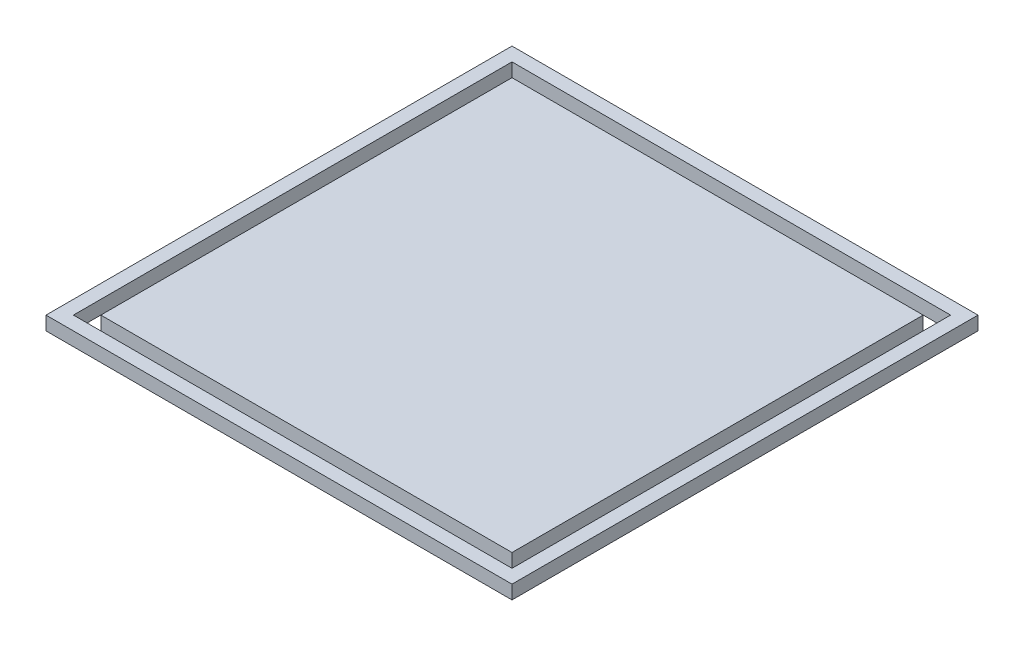
ISO-10303-21;
HEADER;
FILE_DESCRIPTION(('STEP AP214'),'2;1');
FILE_NAME('part.step','',(''),(''),'','','');
FILE_SCHEMA(('AUTOMOTIVE_DESIGN { 1 0 10303 214 1 1 1 1 }'));
ENDSEC;
DATA;
#1=APPLICATION_CONTEXT('core data for automotive mechanical design processes');
#2=APPLICATION_PROTOCOL_DEFINITION('international standard','automotive_design',2000,#1);
#3=PRODUCT_CONTEXT('',#1,'mechanical');
#4=PRODUCT('Part','Part','',(#3));
#5=PRODUCT_RELATED_PRODUCT_CATEGORY('part','',(#4));
#6=PRODUCT_DEFINITION_FORMATION('','',#4);
#7=PRODUCT_DEFINITION_CONTEXT('part definition',#1,'design');
#8=PRODUCT_DEFINITION('design','',#6,#7);
#9=PRODUCT_DEFINITION_SHAPE('','',#8);
#10=(LENGTH_UNIT() NAMED_UNIT(*) SI_UNIT(.MILLI.,.METRE.));
#11=(NAMED_UNIT(*) PLANE_ANGLE_UNIT() SI_UNIT($,.RADIAN.));
#12=(NAMED_UNIT(*) SI_UNIT($,.STERADIAN.) SOLID_ANGLE_UNIT());
#13=UNCERTAINTY_MEASURE_WITH_UNIT(LENGTH_MEASURE(1.E-05),#10,'distance_accuracy_value','');
#14=(GEOMETRIC_REPRESENTATION_CONTEXT(3) GLOBAL_UNCERTAINTY_ASSIGNED_CONTEXT((#13)) GLOBAL_UNIT_ASSIGNED_CONTEXT((#10,
#11,#12)) REPRESENTATION_CONTEXT('',''));
#15=CARTESIAN_POINT('',(0.,0.,0.));
#16=DIRECTION('',(0.,0.,1.));
#17=DIRECTION('',(1.,0.,0.));
#18=AXIS2_PLACEMENT_3D('',#15,#16,#17);
#19=CARTESIAN_POINT('',(150.,10.,0.));
#20=DIRECTION('',(1.,0.,0.));
#21=DIRECTION('',(0.,0.,-1.));
#22=AXIS2_PLACEMENT_3D('',#19,#20,#21);
#23=PLANE('',#22);
#24=DIRECTION('',(0.,0.,1.));
#25=VECTOR('',#24,1.);
#26=CARTESIAN_POINT('',(150.,0.,0.));
#27=LINE('',#26,#25);
#28=CARTESIAN_POINT('',(150.,0.,-150.));
#29=VERTEX_POINT('',#28);
#30=CARTESIAN_POINT('',(150.,0.,150.));
#31=VERTEX_POINT('',#30);
#32=EDGE_CURVE('E147',#29,#31,#27,.T.);
#33=ORIENTED_EDGE('',*,*,#32,.F.);
#34=DIRECTION('',(0.,-1.,0.));
#35=VECTOR('',#34,1.);
#36=CARTESIAN_POINT('',(150.,10.,-150.));
#37=LINE('',#36,#35);
#38=CARTESIAN_POINT('',(150.,10.,-150.));
#39=VERTEX_POINT('',#38);
#40=EDGE_CURVE('E13',#39,#29,#37,.T.);
#41=ORIENTED_EDGE('',*,*,#40,.F.);
#42=DIRECTION('',(0.,0.,1.));
#43=VECTOR('',#42,1.);
#44=CARTESIAN_POINT('',(150.,10.,0.));
#45=LINE('',#44,#43);
#46=CARTESIAN_POINT('',(150.,10.,150.));
#47=VERTEX_POINT('',#46);
#48=EDGE_CURVE('E136',#39,#47,#45,.T.);
#49=ORIENTED_EDGE('',*,*,#48,.T.);
#50=DIRECTION('',(0.,-1.,0.));
#51=VECTOR('',#50,1.);
#52=CARTESIAN_POINT('',(150.,10.,150.));
#53=LINE('',#52,#51);
#54=EDGE_CURVE('E96',#47,#31,#53,.T.);
#55=ORIENTED_EDGE('',*,*,#54,.T.);
#56=EDGE_LOOP('',(#33,#41,#49,#55));
#57=FACE_BOUND('',#56,.T.);
#58=ADVANCED_FACE('F79',(#57),#23,.T.);
#59=CARTESIAN_POINT('',(0.,10.,-150.));
#60=DIRECTION('',(0.,0.,-1.));
#61=DIRECTION('',(-1.,0.,0.));
#62=AXIS2_PLACEMENT_3D('',#59,#60,#61);
#63=PLANE('',#62);
#64=DIRECTION('',(1.,0.,0.));
#65=VECTOR('',#64,1.);
#66=CARTESIAN_POINT('',(0.,0.,-150.));
#67=LINE('',#66,#65);
#68=CARTESIAN_POINT('',(-150.,0.,-150.));
#69=VERTEX_POINT('',#68);
#70=EDGE_CURVE('E126',#69,#29,#67,.T.);
#71=ORIENTED_EDGE('',*,*,#70,.F.);
#72=DIRECTION('',(0.,-1.,0.));
#73=VECTOR('',#72,1.);
#74=CARTESIAN_POINT('',(-150.,10.,-150.));
#75=LINE('',#74,#73);
#76=CARTESIAN_POINT('',(-150.,10.,-150.));
#77=VERTEX_POINT('',#76);
#78=EDGE_CURVE('E88',#77,#69,#75,.T.);
#79=ORIENTED_EDGE('',*,*,#78,.F.);
#80=DIRECTION('',(1.,0.,0.));
#81=VECTOR('',#80,1.);
#82=CARTESIAN_POINT('',(0.,10.,-150.));
#83=LINE('',#82,#81);
#84=EDGE_CURVE('E124',#77,#39,#83,.T.);
#85=ORIENTED_EDGE('',*,*,#84,.T.);
#86=ORIENTED_EDGE('',*,*,#40,.T.);
#87=EDGE_LOOP('',(#71,#79,#85,#86));
#88=FACE_BOUND('',#87,.T.);
#89=ADVANCED_FACE('F123',(#88),#63,.T.);
#90=CARTESIAN_POINT('',(-150.,10.,0.));
#91=DIRECTION('',(-1.,0.,0.));
#92=DIRECTION('',(0.,0.,1.));
#93=AXIS2_PLACEMENT_3D('',#90,#91,#92);
#94=PLANE('',#93);
#95=DIRECTION('',(0.,0.,-1.));
#96=VECTOR('',#95,1.);
#97=CARTESIAN_POINT('',(-150.,0.,0.));
#98=LINE('',#97,#96);
#99=CARTESIAN_POINT('',(-150.,0.,150.));
#100=VERTEX_POINT('',#99);
#101=EDGE_CURVE('E152',#100,#69,#98,.T.);
#102=ORIENTED_EDGE('',*,*,#101,.F.);
#103=DIRECTION('',(0.,-1.,0.));
#104=VECTOR('',#103,1.);
#105=CARTESIAN_POINT('',(-150.,10.,150.));
#106=LINE('',#105,#104);
#107=CARTESIAN_POINT('',(-150.,10.,150.));
#108=VERTEX_POINT('',#107);
#109=EDGE_CURVE('E109',#108,#100,#106,.T.);
#110=ORIENTED_EDGE('',*,*,#109,.F.);
#111=DIRECTION('',(0.,0.,-1.));
#112=VECTOR('',#111,1.);
#113=CARTESIAN_POINT('',(-150.,10.,0.));
#114=LINE('',#113,#112);
#115=EDGE_CURVE('E135',#108,#77,#114,.T.);
#116=ORIENTED_EDGE('',*,*,#115,.T.);
#117=ORIENTED_EDGE('',*,*,#78,.T.);
#118=EDGE_LOOP('',(#102,#110,#116,#117));
#119=FACE_BOUND('',#118,.T.);
#120=ADVANCED_FACE('F139',(#119),#94,.T.);
#121=CARTESIAN_POINT('',(0.,10.,150.));
#122=DIRECTION('',(0.,0.,1.));
#123=DIRECTION('',(1.,0.,0.));
#124=AXIS2_PLACEMENT_3D('',#121,#122,#123);
#125=PLANE('',#124);
#126=DIRECTION('',(-1.,0.,0.));
#127=VECTOR('',#126,1.);
#128=CARTESIAN_POINT('',(0.,0.,150.));
#129=LINE('',#128,#127);
#130=EDGE_CURVE('E155',#31,#100,#129,.T.);
#131=ORIENTED_EDGE('',*,*,#130,.F.);
#132=ORIENTED_EDGE('',*,*,#54,.F.);
#133=DIRECTION('',(-1.,0.,0.));
#134=VECTOR('',#133,1.);
#135=CARTESIAN_POINT('',(0.,10.,150.));
#136=LINE('',#135,#134);
#137=EDGE_CURVE('E141',#47,#108,#136,.T.);
#138=ORIENTED_EDGE('',*,*,#137,.T.);
#139=ORIENTED_EDGE('',*,*,#109,.T.);
#140=EDGE_LOOP('',(#131,#132,#138,#139));
#141=FACE_BOUND('',#140,.T.);
#142=ADVANCED_FACE('F164',(#141),#125,.T.);
#143=CARTESIAN_POINT('',(0.,10.,0.));
#144=DIRECTION('',(0.,1.,0.));
#145=DIRECTION('',(0.,0.,1.));
#146=AXIS2_PLACEMENT_3D('',#143,#144,#145);
#147=PLANE('',#146);
#148=ORIENTED_EDGE('',*,*,#48,.F.);
#149=ORIENTED_EDGE('',*,*,#84,.F.);
#150=ORIENTED_EDGE('',*,*,#115,.F.);
#151=ORIENTED_EDGE('',*,*,#137,.F.);
#152=EDGE_LOOP('',(#148,#149,#150,#151));
#153=FACE_BOUND('',#152,.T.);
#154=ADVANCED_FACE('F133',(#153),#147,.T.);
#155=CARTESIAN_POINT('',(0.,0.,0.));
#156=DIRECTION('',(0.,1.,0.));
#157=DIRECTION('',(0.,0.,1.));
#158=AXIS2_PLACEMENT_3D('',#155,#156,#157);
#159=PLANE('',#158);
#160=ORIENTED_EDGE('',*,*,#32,.T.);
#161=ORIENTED_EDGE('',*,*,#130,.T.);
#162=ORIENTED_EDGE('',*,*,#101,.T.);
#163=ORIENTED_EDGE('',*,*,#70,.T.);
#164=EDGE_LOOP('',(#160,#161,#162,#163));
#165=FACE_BOUND('',#164,.T.);
#166=ADVANCED_FACE('F171',(#165),#159,.F.);
#167=CLOSED_SHELL('',(#58,#89,#120,#142,#154,#166));
#168=MANIFOLD_SOLID_BREP('B2',#167);
#169=CARTESIAN_POINT('',(0.,10.,160.));
#170=DIRECTION('',(0.,0.,1.));
#171=DIRECTION('',(1.,0.,0.));
#172=AXIS2_PLACEMENT_3D('',#169,#170,#171);
#173=PLANE('',#172);
#174=DIRECTION('',(-1.,0.,0.));
#175=VECTOR('',#174,1.);
#176=CARTESIAN_POINT('',(0.,0.,160.));
#177=LINE('',#176,#175);
#178=CARTESIAN_POINT('',(160.,0.,160.));
#179=VERTEX_POINT('',#178);
#180=CARTESIAN_POINT('',(-160.,0.,160.));
#181=VERTEX_POINT('',#180);
#182=EDGE_CURVE('E355',#179,#181,#177,.T.);
#183=ORIENTED_EDGE('',*,*,#182,.T.);
#184=DIRECTION('',(0.,-1.,0.));
#185=VECTOR('',#184,1.);
#186=CARTESIAN_POINT('',(-160.,10.,160.));
#187=LINE('',#186,#185);
#188=CARTESIAN_POINT('',(-160.,10.,160.));
#189=VERTEX_POINT('',#188);
#190=EDGE_CURVE('E77',#189,#181,#187,.T.);
#191=ORIENTED_EDGE('',*,*,#190,.F.);
#192=DIRECTION('',(-1.,0.,0.));
#193=VECTOR('',#192,1.);
#194=CARTESIAN_POINT('',(0.,10.,160.));
#195=LINE('',#194,#193);
#196=CARTESIAN_POINT('',(160.,10.,160.));
#197=VERTEX_POINT('',#196);
#198=EDGE_CURVE('E329',#197,#189,#195,.T.);
#199=ORIENTED_EDGE('',*,*,#198,.F.);
#200=DIRECTION('',(0.,-1.,0.));
#201=VECTOR('',#200,1.);
#202=CARTESIAN_POINT('',(160.,10.,160.));
#203=LINE('',#202,#201);
#204=EDGE_CURVE('E362',#197,#179,#203,.T.);
#205=ORIENTED_EDGE('',*,*,#204,.T.);
#206=EDGE_LOOP('',(#183,#191,#199,#205));
#207=FACE_BOUND('',#206,.T.);
#208=ADVANCED_FACE('F248',(#207),#173,.F.);
#209=CARTESIAN_POINT('',(-160.,10.,0.));
#210=DIRECTION('',(-1.,0.,0.));
#211=DIRECTION('',(0.,0.,1.));
#212=AXIS2_PLACEMENT_3D('',#209,#210,#211);
#213=PLANE('',#212);
#214=DIRECTION('',(0.,0.,-1.));
#215=VECTOR('',#214,1.);
#216=CARTESIAN_POINT('',(-160.,0.,0.));
#217=LINE('',#216,#215);
#218=CARTESIAN_POINT('',(-160.,0.,-160.));
#219=VERTEX_POINT('',#218);
#220=EDGE_CURVE('E334',#181,#219,#217,.T.);
#221=ORIENTED_EDGE('',*,*,#220,.T.);
#222=DIRECTION('',(0.,-1.,0.));
#223=VECTOR('',#222,1.);
#224=CARTESIAN_POINT('',(-160.,10.,-160.));
#225=LINE('',#224,#223);
#226=CARTESIAN_POINT('',(-160.,10.,-160.));
#227=VERTEX_POINT('',#226);
#228=EDGE_CURVE('E258',#227,#219,#225,.T.);
#229=ORIENTED_EDGE('',*,*,#228,.F.);
#230=DIRECTION('',(0.,0.,-1.));
#231=VECTOR('',#230,1.);
#232=CARTESIAN_POINT('',(-160.,10.,0.));
#233=LINE('',#232,#231);
#234=EDGE_CURVE('E323',#189,#227,#233,.T.);
#235=ORIENTED_EDGE('',*,*,#234,.F.);
#236=ORIENTED_EDGE('',*,*,#190,.T.);
#237=EDGE_LOOP('',(#221,#229,#235,#236));
#238=FACE_BOUND('',#237,.T.);
#239=ADVANCED_FACE('F333',(#238),#213,.F.);
#240=CARTESIAN_POINT('',(0.,10.,-160.));
#241=DIRECTION('',(0.,0.,-1.));
#242=DIRECTION('',(-1.,0.,0.));
#243=AXIS2_PLACEMENT_3D('',#240,#241,#242);
#244=PLANE('',#243);
#245=DIRECTION('',(1.,0.,0.));
#246=VECTOR('',#245,1.);
#247=CARTESIAN_POINT('',(0.,0.,-160.));
#248=LINE('',#247,#246);
#249=CARTESIAN_POINT('',(160.,0.,-160.));
#250=VERTEX_POINT('',#249);
#251=EDGE_CURVE('E296',#219,#250,#248,.T.);
#252=ORIENTED_EDGE('',*,*,#251,.T.);
#253=DIRECTION('',(0.,-1.,0.));
#254=VECTOR('',#253,1.);
#255=CARTESIAN_POINT('',(160.,10.,-160.));
#256=LINE('',#255,#254);
#257=CARTESIAN_POINT('',(160.,10.,-160.));
#258=VERTEX_POINT('',#257);
#259=EDGE_CURVE('E335',#258,#250,#256,.T.);
#260=ORIENTED_EDGE('',*,*,#259,.F.);
#261=DIRECTION('',(1.,0.,0.));
#262=VECTOR('',#261,1.);
#263=CARTESIAN_POINT('',(0.,10.,-160.));
#264=LINE('',#263,#262);
#265=EDGE_CURVE('E327',#227,#258,#264,.T.);
#266=ORIENTED_EDGE('',*,*,#265,.F.);
#267=ORIENTED_EDGE('',*,*,#228,.T.);
#268=EDGE_LOOP('',(#252,#260,#266,#267));
#269=FACE_BOUND('',#268,.T.);
#270=ADVANCED_FACE('F337',(#269),#244,.F.);
#271=CARTESIAN_POINT('',(0.,10.,170.));
#272=DIRECTION('',(0.,0.,1.));
#273=DIRECTION('',(1.,0.,0.));
#274=AXIS2_PLACEMENT_3D('',#271,#272,#273);
#275=PLANE('',#274);
#276=DIRECTION('',(-1.,0.,0.));
#277=VECTOR('',#276,1.);
#278=CARTESIAN_POINT('',(0.,0.,170.));
#279=LINE('',#278,#277);
#280=CARTESIAN_POINT('',(170.,0.,170.));
#281=VERTEX_POINT('',#280);
#282=CARTESIAN_POINT('',(-170.,0.,170.));
#283=VERTEX_POINT('',#282);
#284=EDGE_CURVE('E343',#281,#283,#279,.T.);
#285=ORIENTED_EDGE('',*,*,#284,.F.);
#286=DIRECTION('',(0.,-1.,0.));
#287=VECTOR('',#286,1.);
#288=CARTESIAN_POINT('',(170.,10.,170.));
#289=LINE('',#288,#287);
#290=CARTESIAN_POINT('',(170.,10.,170.));
#291=VERTEX_POINT('',#290);
#292=EDGE_CURVE('E252',#291,#281,#289,.T.);
#293=ORIENTED_EDGE('',*,*,#292,.F.);
#294=DIRECTION('',(-1.,0.,0.));
#295=VECTOR('',#294,1.);
#296=CARTESIAN_POINT('',(0.,10.,170.));
#297=LINE('',#296,#295);
#298=CARTESIAN_POINT('',(-170.,10.,170.));
#299=VERTEX_POINT('',#298);
#300=EDGE_CURVE('E361',#291,#299,#297,.T.);
#301=ORIENTED_EDGE('',*,*,#300,.T.);
#302=DIRECTION('',(0.,-1.,0.));
#303=VECTOR('',#302,1.);
#304=CARTESIAN_POINT('',(-170.,10.,170.));
#305=LINE('',#304,#303);
#306=EDGE_CURVE('E339',#299,#283,#305,.T.);
#307=ORIENTED_EDGE('',*,*,#306,.T.);
#308=EDGE_LOOP('',(#285,#293,#301,#307));
#309=FACE_BOUND('',#308,.T.);
#310=ADVANCED_FACE('F250',(#309),#275,.T.);
#311=CARTESIAN_POINT('',(170.,10.,0.));
#312=DIRECTION('',(1.,0.,0.));
#313=DIRECTION('',(0.,0.,-1.));
#314=AXIS2_PLACEMENT_3D('',#311,#312,#313);
#315=PLANE('',#314);
#316=DIRECTION('',(0.,0.,1.));
#317=VECTOR('',#316,1.);
#318=CARTESIAN_POINT('',(170.,0.,0.));
#319=LINE('',#318,#317);
#320=CARTESIAN_POINT('',(170.,0.,-170.));
#321=VERTEX_POINT('',#320);
#322=EDGE_CURVE('E346',#321,#281,#319,.T.);
#323=ORIENTED_EDGE('',*,*,#322,.F.);
#324=DIRECTION('',(0.,-1.,0.));
#325=VECTOR('',#324,1.);
#326=CARTESIAN_POINT('',(170.,10.,-170.));
#327=LINE('',#326,#325);
#328=CARTESIAN_POINT('',(170.,10.,-170.));
#329=VERTEX_POINT('',#328);
#330=EDGE_CURVE('E367',#329,#321,#327,.T.);
#331=ORIENTED_EDGE('',*,*,#330,.F.);
#332=DIRECTION('',(0.,0.,1.));
#333=VECTOR('',#332,1.);
#334=CARTESIAN_POINT('',(170.,10.,0.));
#335=LINE('',#334,#333);
#336=EDGE_CURVE('E376',#329,#291,#335,.T.);
#337=ORIENTED_EDGE('',*,*,#336,.T.);
#338=ORIENTED_EDGE('',*,*,#292,.T.);
#339=EDGE_LOOP('',(#323,#331,#337,#338));
#340=FACE_BOUND('',#339,.T.);
#341=ADVANCED_FACE('F374',(#340),#315,.T.);
#342=CARTESIAN_POINT('',(0.,10.,-170.));
#343=DIRECTION('',(0.,0.,-1.));
#344=DIRECTION('',(-1.,0.,0.));
#345=AXIS2_PLACEMENT_3D('',#342,#343,#344);
#346=PLANE('',#345);
#347=DIRECTION('',(1.,0.,0.));
#348=VECTOR('',#347,1.);
#349=CARTESIAN_POINT('',(0.,0.,-170.));
#350=LINE('',#349,#348);
#351=CARTESIAN_POINT('',(-170.,0.,-170.));
#352=VERTEX_POINT('',#351);
#353=EDGE_CURVE('E349',#352,#321,#350,.T.);
#354=ORIENTED_EDGE('',*,*,#353,.F.);
#355=DIRECTION('',(0.,-1.,0.));
#356=VECTOR('',#355,1.);
#357=CARTESIAN_POINT('',(-170.,10.,-170.));
#358=LINE('',#357,#356);
#359=CARTESIAN_POINT('',(-170.,10.,-170.));
#360=VERTEX_POINT('',#359);
#361=EDGE_CURVE('E366',#360,#352,#358,.T.);
#362=ORIENTED_EDGE('',*,*,#361,.F.);
#363=DIRECTION('',(1.,0.,0.));
#364=VECTOR('',#363,1.);
#365=CARTESIAN_POINT('',(0.,10.,-170.));
#366=LINE('',#365,#364);
#367=EDGE_CURVE('E383',#360,#329,#366,.T.);
#368=ORIENTED_EDGE('',*,*,#367,.T.);
#369=ORIENTED_EDGE('',*,*,#330,.T.);
#370=EDGE_LOOP('',(#354,#362,#368,#369));
#371=FACE_BOUND('',#370,.T.);
#372=ADVANCED_FACE('F381',(#371),#346,.T.);
#373=CARTESIAN_POINT('',(-170.,10.,0.));
#374=DIRECTION('',(-1.,0.,0.));
#375=DIRECTION('',(0.,0.,1.));
#376=AXIS2_PLACEMENT_3D('',#373,#374,#375);
#377=PLANE('',#376);
#378=DIRECTION('',(0.,0.,-1.));
#379=VECTOR('',#378,1.);
#380=CARTESIAN_POINT('',(-170.,0.,0.));
#381=LINE('',#380,#379);
#382=EDGE_CURVE('E352',#283,#352,#381,.T.);
#383=ORIENTED_EDGE('',*,*,#382,.F.);
#384=ORIENTED_EDGE('',*,*,#306,.F.);
#385=DIRECTION('',(0.,0.,-1.));
#386=VECTOR('',#385,1.);
#387=CARTESIAN_POINT('',(-170.,10.,0.));
#388=LINE('',#387,#386);
#389=EDGE_CURVE('E388',#299,#360,#388,.T.);
#390=ORIENTED_EDGE('',*,*,#389,.T.);
#391=ORIENTED_EDGE('',*,*,#361,.T.);
#392=EDGE_LOOP('',(#383,#384,#390,#391));
#393=FACE_BOUND('',#392,.T.);
#394=ADVANCED_FACE('F390',(#393),#377,.T.);
#395=CARTESIAN_POINT('',(160.,10.,0.));
#396=DIRECTION('',(1.,0.,0.));
#397=DIRECTION('',(0.,0.,-1.));
#398=AXIS2_PLACEMENT_3D('',#395,#396,#397);
#399=PLANE('',#398);
#400=DIRECTION('',(0.,0.,1.));
#401=VECTOR('',#400,1.);
#402=CARTESIAN_POINT('',(160.,0.,0.));
#403=LINE('',#402,#401);
#404=EDGE_CURVE('E302',#250,#179,#403,.T.);
#405=ORIENTED_EDGE('',*,*,#404,.T.);
#406=ORIENTED_EDGE('',*,*,#204,.F.);
#407=DIRECTION('',(0.,0.,1.));
#408=VECTOR('',#407,1.);
#409=CARTESIAN_POINT('',(160.,10.,0.));
#410=LINE('',#409,#408);
#411=EDGE_CURVE('E267',#258,#197,#410,.T.);
#412=ORIENTED_EDGE('',*,*,#411,.F.);
#413=ORIENTED_EDGE('',*,*,#259,.T.);
#414=EDGE_LOOP('',(#405,#406,#412,#413));
#415=FACE_BOUND('',#414,.T.);
#416=ADVANCED_FACE('F395',(#415),#399,.F.);
#417=CARTESIAN_POINT('',(0.,10.,0.));
#418=DIRECTION('',(0.,1.,0.));
#419=DIRECTION('',(0.,0.,1.));
#420=AXIS2_PLACEMENT_3D('',#417,#418,#419);
#421=PLANE('',#420);
#422=ORIENTED_EDGE('',*,*,#300,.F.);
#423=ORIENTED_EDGE('',*,*,#336,.F.);
#424=ORIENTED_EDGE('',*,*,#367,.F.);
#425=ORIENTED_EDGE('',*,*,#389,.F.);
#426=EDGE_LOOP('',(#422,#423,#424,#425));
#427=FACE_BOUND('',#426,.T.);
#428=ORIENTED_EDGE('',*,*,#198,.T.);
#429=ORIENTED_EDGE('',*,*,#234,.T.);
#430=ORIENTED_EDGE('',*,*,#265,.T.);
#431=ORIENTED_EDGE('',*,*,#411,.T.);
#432=EDGE_LOOP('',(#428,#429,#430,#431));
#433=FACE_BOUND('',#432,.T.);
#434=ADVANCED_FACE('F325',(#427,#433),#421,.T.);
#435=CARTESIAN_POINT('',(0.,0.,0.));
#436=DIRECTION('',(0.,1.,0.));
#437=DIRECTION('',(0.,0.,1.));
#438=AXIS2_PLACEMENT_3D('',#435,#436,#437);
#439=PLANE('',#438);
#440=ORIENTED_EDGE('',*,*,#284,.T.);
#441=ORIENTED_EDGE('',*,*,#382,.T.);
#442=ORIENTED_EDGE('',*,*,#353,.T.);
#443=ORIENTED_EDGE('',*,*,#322,.T.);
#444=EDGE_LOOP('',(#440,#441,#442,#443));
#445=FACE_BOUND('',#444,.T.);
#446=ORIENTED_EDGE('',*,*,#182,.F.);
#447=ORIENTED_EDGE('',*,*,#404,.F.);
#448=ORIENTED_EDGE('',*,*,#251,.F.);
#449=ORIENTED_EDGE('',*,*,#220,.F.);
#450=EDGE_LOOP('',(#446,#447,#448,#449));
#451=FACE_BOUND('',#450,.T.);
#452=ADVANCED_FACE('F379',(#445,#451),#439,.F.);
#453=CLOSED_SHELL('',(#208,#239,#270,#310,#341,#372,#394,#416,#434,#452));
#454=MANIFOLD_SOLID_BREP('B7',#453);
#455=ADVANCED_BREP_SHAPE_REPRESENTATION('',(#18,#168,#454),#14);
#456=SHAPE_DEFINITION_REPRESENTATION(#9,#455);
ENDSEC;
END-ISO-10303-21;
